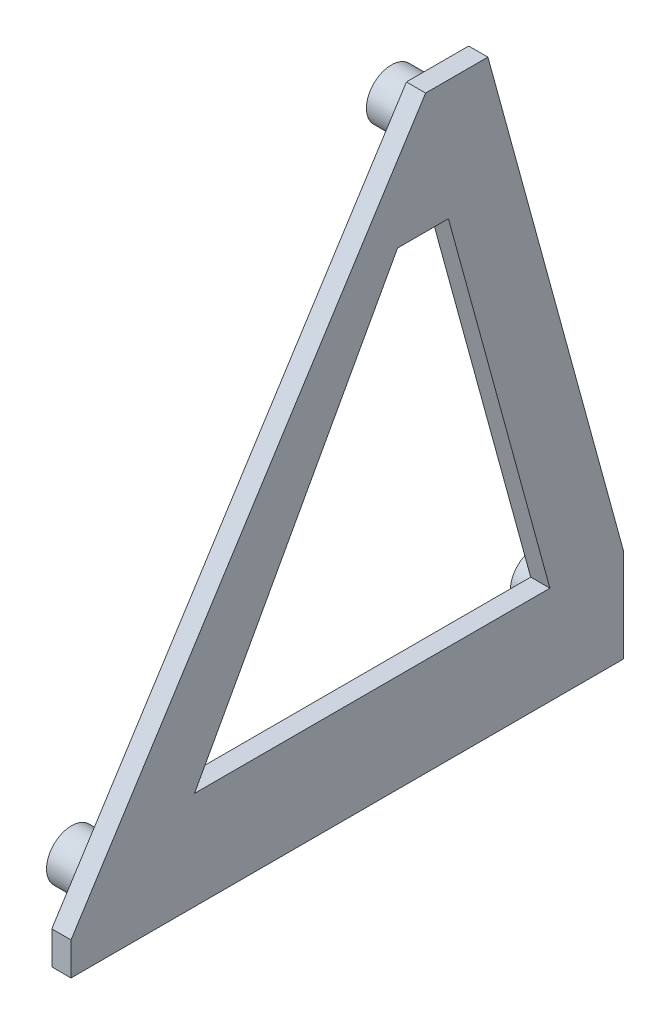
ISO-10303-21;
HEADER;
FILE_DESCRIPTION(('STEP AP214'),'2;1');
FILE_NAME('part.step','',(''),(''),'','','');
FILE_SCHEMA(('AUTOMOTIVE_DESIGN { 1 0 10303 214 1 1 1 1 }'));
ENDSEC;
DATA;
#1=APPLICATION_CONTEXT('core data for automotive mechanical design processes');
#2=APPLICATION_PROTOCOL_DEFINITION('international standard','automotive_design',2000,#1);
#3=PRODUCT_CONTEXT('',#1,'mechanical');
#4=PRODUCT('Part','Part','',(#3));
#5=PRODUCT_RELATED_PRODUCT_CATEGORY('part','',(#4));
#6=PRODUCT_DEFINITION_FORMATION('','',#4);
#7=PRODUCT_DEFINITION_CONTEXT('part definition',#1,'design');
#8=PRODUCT_DEFINITION('design','',#6,#7);
#9=PRODUCT_DEFINITION_SHAPE('','',#8);
#10=(LENGTH_UNIT() NAMED_UNIT(*) SI_UNIT(.MILLI.,.METRE.));
#11=(NAMED_UNIT(*) PLANE_ANGLE_UNIT() SI_UNIT($,.RADIAN.));
#12=(NAMED_UNIT(*) SI_UNIT($,.STERADIAN.) SOLID_ANGLE_UNIT());
#13=UNCERTAINTY_MEASURE_WITH_UNIT(LENGTH_MEASURE(1.E-05),#10,'distance_accuracy_value','');
#14=(GEOMETRIC_REPRESENTATION_CONTEXT(3) GLOBAL_UNCERTAINTY_ASSIGNED_CONTEXT((#13)) GLOBAL_UNIT_ASSIGNED_CONTEXT((#10,
#11,#12)) REPRESENTATION_CONTEXT('',''));
#15=CARTESIAN_POINT('',(0.,0.,0.));
#16=DIRECTION('',(0.,0.,1.));
#17=DIRECTION('',(1.,0.,0.));
#18=AXIS2_PLACEMENT_3D('',#15,#16,#17);
#19=CARTESIAN_POINT('',(0.,0.,0.));
#20=DIRECTION('',(1.,0.,0.));
#21=DIRECTION('',(0.,0.,-1.));
#22=AXIS2_PLACEMENT_3D('',#19,#20,#21);
#23=PLANE('',#22);
#24=CARTESIAN_POINT('',(0.,33.8767009875767,-6.29578165334206));
#25=DIRECTION('',(1.,0.,0.));
#26=DIRECTION('',(0.,0.,-1.));
#27=AXIS2_PLACEMENT_3D('',#24,#25,#26);
#28=CIRCLE('',#27,2.6);
#29=CARTESIAN_POINT('',(0.,33.8767009875767,-8.89578165334206));
#30=VERTEX_POINT('',#29);
#31=EDGE_CURVE('E491',#30,#30,#28,.T.);
#32=ORIENTED_EDGE('',*,*,#31,.T.);
#33=EDGE_LOOP('',(#32));
#34=FACE_BOUND('',#33,.T.);
#35=CARTESIAN_POINT('',(0.,-17.0642630207731,-21.2833827255621));
#36=DIRECTION('',(1.,0.,0.));
#37=DIRECTION('',(0.,0.,-1.));
#38=AXIS2_PLACEMENT_3D('',#35,#36,#37);
#39=CIRCLE('',#38,2.6);
#40=CARTESIAN_POINT('',(0.,-17.0642630207731,-23.8833827255621));
#41=VERTEX_POINT('',#40);
#42=EDGE_CURVE('E318',#41,#41,#39,.T.);
#43=ORIENTED_EDGE('',*,*,#42,.T.);
#44=EDGE_LOOP('',(#43));
#45=FACE_BOUND('',#44,.T.);
#46=CARTESIAN_POINT('',(0.,-18.0642630207731,27.0062641979763));
#47=DIRECTION('',(1.,0.,0.));
#48=DIRECTION('',(0.,0.,-1.));
#49=AXIS2_PLACEMENT_3D('',#46,#47,#48);
#50=CIRCLE('',#49,2.6);
#51=CARTESIAN_POINT('',(0.,-18.0642630207731,24.4062641979763));
#52=VERTEX_POINT('',#51);
#53=EDGE_CURVE('E145',#52,#52,#50,.T.);
#54=ORIENTED_EDGE('',*,*,#53,.T.);
#55=EDGE_LOOP('',(#54));
#56=FACE_BOUND('',#55,.T.);
#57=DIRECTION('',(0.,0.964519820461621,0.264010446643087));
#58=VECTOR('',#57,1.);
#59=CARTESIAN_POINT('',(0.,-12.9534799780657,-16.8003106717052));
#60=LINE('',#59,#58);
#61=CARTESIAN_POINT('',(0.,-12.9534799780657,-16.8003106717052));
#62=VERTEX_POINT('',#61);
#63=CARTESIAN_POINT('',(0.,25.644128730967,-6.23528992412758));
#64=VERTEX_POINT('',#63);
#65=EDGE_CURVE('E127',#62,#64,#60,.T.);
#66=ORIENTED_EDGE('',*,*,#65,.T.);
#67=DIRECTION('',(0.,0.,1.));
#68=VECTOR('',#67,1.);
#69=CARTESIAN_POINT('',(0.,25.644128730967,-6.23528992412758));
#70=LINE('',#69,#68);
#71=CARTESIAN_POINT('',(0.,25.644128730967,-0.937037540538199));
#72=VERTEX_POINT('',#71);
#73=EDGE_CURVE('E120',#64,#72,#70,.T.);
#74=ORIENTED_EDGE('',*,*,#73,.T.);
#75=DIRECTION('',(0.,-0.877051226933812,0.48039686232728));
#76=VECTOR('',#75,1.);
#77=CARTESIAN_POINT('',(0.,25.644128730967,-0.937037540538199));
#78=LINE('',#77,#76);
#79=CARTESIAN_POINT('',(0.,-12.9534799780657,20.2044528852596));
#80=VERTEX_POINT('',#79);
#81=EDGE_CURVE('E130',#72,#80,#78,.T.);
#82=ORIENTED_EDGE('',*,*,#81,.T.);
#83=DIRECTION('',(0.,0.,-1.));
#84=VECTOR('',#83,1.);
#85=CARTESIAN_POINT('',(0.,-12.9534799780657,20.2044528852596));
#86=LINE('',#85,#84);
#87=EDGE_CURVE('E56',#80,#62,#86,.T.);
#88=ORIENTED_EDGE('',*,*,#87,.T.);
#89=EDGE_LOOP('',(#66,#74,#82,#88));
#90=FACE_BOUND('',#89,.T.);
#91=DIRECTION('',(0.,0.,1.));
#92=VECTOR('',#91,1.);
#93=CARTESIAN_POINT('',(0.,38.1571821444435,-10.3448638273174));
#94=LINE('',#93,#92);
#95=CARTESIAN_POINT('',(0.,38.1571821444435,-10.3448638273174));
#96=VERTEX_POINT('',#95);
#97=CARTESIAN_POINT('',(0.,38.1571821444435,-3.86159879742389));
#98=VERTEX_POINT('',#97);
#99=EDGE_CURVE('E169',#96,#98,#94,.T.);
#100=ORIENTED_EDGE('',*,*,#99,.F.);
#101=DIRECTION('',(0.,0.96453296414237,0.263962423618844));
#102=VECTOR('',#101,1.);
#103=CARTESIAN_POINT('',(0.,-13.403843269769,-24.4554994806153));
#104=LINE('',#103,#102);
#105=CARTESIAN_POINT('',(0.,-13.403843269769,-24.4554994806153));
#106=VERTEX_POINT('',#105);
#107=EDGE_CURVE('E189',#106,#96,#104,.T.);
#108=ORIENTED_EDGE('',*,*,#107,.F.);
#109=DIRECTION('',(0.,1.,0.));
#110=VECTOR('',#109,1.);
#111=CARTESIAN_POINT('',(0.,-13.403843269769,-24.4554994806153));
#112=LINE('',#111,#110);
#113=CARTESIAN_POINT('',(0.,-23.1668776677264,-24.4554994806153));
#114=VERTEX_POINT('',#113);
#115=EDGE_CURVE('E185',#114,#106,#112,.T.);
#116=ORIENTED_EDGE('',*,*,#115,.F.);
#117=DIRECTION('',(0.,0.,-1.));
#118=VECTOR('',#117,1.);
#119=CARTESIAN_POINT('',(0.,-23.1668776677264,33.0548750198525));
#120=LINE('',#119,#118);
#121=CARTESIAN_POINT('',(0.,-23.1668776677264,33.0548750198525));
#122=VERTEX_POINT('',#121);
#123=EDGE_CURVE('E181',#122,#114,#120,.T.);
#124=ORIENTED_EDGE('',*,*,#123,.F.);
#125=DIRECTION('',(0.,-1.,0.));
#126=VECTOR('',#125,1.);
#127=CARTESIAN_POINT('',(0.,-19.7345608871945,33.0548750198525));
#128=LINE('',#127,#126);
#129=CARTESIAN_POINT('',(0.,-19.7345608871945,33.0548750198525));
#130=VERTEX_POINT('',#129);
#131=EDGE_CURVE('E177',#130,#122,#128,.T.);
#132=ORIENTED_EDGE('',*,*,#131,.F.);
#133=DIRECTION('',(0.,-0.843157953899936,0.537665941617351));
#134=VECTOR('',#133,1.);
#135=CARTESIAN_POINT('',(0.,38.1571821444435,-3.86159879742388));
#136=LINE('',#135,#134);
#137=EDGE_CURVE('E172',#98,#130,#136,.T.);
#138=ORIENTED_EDGE('',*,*,#137,.F.);
#139=EDGE_LOOP('',(#100,#108,#116,#124,#132,#138));
#140=FACE_BOUND('',#139,.T.);
#141=ADVANCED_FACE('F39',(#34,#45,#56,#90,#140),#23,.F.);
#142=CARTESIAN_POINT('',(0.,38.1571821444435,-10.3448638273174));
#143=DIRECTION('',(0.,1.,0.));
#144=DIRECTION('',(0.,0.,1.));
#145=AXIS2_PLACEMENT_3D('',#142,#143,#144);
#146=PLANE('',#145);
#147=DIRECTION('',(0.,0.,1.));
#148=VECTOR('',#147,1.);
#149=CARTESIAN_POINT('',(2.,38.1571821444435,-10.3448638273174));
#150=LINE('',#149,#148);
#151=CARTESIAN_POINT('',(2.,38.1571821444435,-10.3448638273174));
#152=VERTEX_POINT('',#151);
#153=CARTESIAN_POINT('',(2.,38.1571821444435,-3.86159879742389));
#154=VERTEX_POINT('',#153);
#155=EDGE_CURVE('E163',#152,#154,#150,.T.);
#156=ORIENTED_EDGE('',*,*,#155,.F.);
#157=DIRECTION('',(1.,0.,0.));
#158=VECTOR('',#157,1.);
#159=CARTESIAN_POINT('',(0.,38.1571821444435,-10.3448638273174));
#160=LINE('',#159,#158);
#161=EDGE_CURVE('E215',#96,#152,#160,.T.);
#162=ORIENTED_EDGE('',*,*,#161,.F.);
#163=ORIENTED_EDGE('',*,*,#99,.T.);
#164=DIRECTION('',(1.,0.,0.));
#165=VECTOR('',#164,1.);
#166=CARTESIAN_POINT('',(0.,38.1571821444435,-3.86159879742388));
#167=LINE('',#166,#165);
#168=EDGE_CURVE('E42',#98,#154,#167,.T.);
#169=ORIENTED_EDGE('',*,*,#168,.T.);
#170=EDGE_LOOP('',(#156,#162,#163,#169));
#171=FACE_BOUND('',#170,.T.);
#172=ADVANCED_FACE('F236',(#171),#146,.T.);
#173=CARTESIAN_POINT('',(0.,-13.403843269769,-24.4554994806153));
#174=DIRECTION('',(0.,0.263962423618844,-0.96453296414237));
#175=DIRECTION('',(0.,0.96453296414237,0.263962423618844));
#176=AXIS2_PLACEMENT_3D('',#173,#174,#175);
#177=PLANE('',#176);
#178=DIRECTION('',(0.,0.96453296414237,0.263962423618844));
#179=VECTOR('',#178,1.);
#180=CARTESIAN_POINT('',(2.,-13.403843269769,-24.4554994806153));
#181=LINE('',#180,#179);
#182=CARTESIAN_POINT('',(2.,-13.403843269769,-24.4554994806153));
#183=VERTEX_POINT('',#182);
#184=EDGE_CURVE('E173',#183,#152,#181,.T.);
#185=ORIENTED_EDGE('',*,*,#184,.F.);
#186=DIRECTION('',(1.,0.,0.));
#187=VECTOR('',#186,1.);
#188=CARTESIAN_POINT('',(0.,-13.403843269769,-24.4554994806153));
#189=LINE('',#188,#187);
#190=EDGE_CURVE('E219',#106,#183,#189,.T.);
#191=ORIENTED_EDGE('',*,*,#190,.F.);
#192=ORIENTED_EDGE('',*,*,#107,.T.);
#193=ORIENTED_EDGE('',*,*,#161,.T.);
#194=EDGE_LOOP('',(#185,#191,#192,#193));
#195=FACE_BOUND('',#194,.T.);
#196=ADVANCED_FACE('F245',(#195),#177,.T.);
#197=CARTESIAN_POINT('',(0.,-13.403843269769,-24.4554994806153));
#198=DIRECTION('',(0.,0.,-1.));
#199=DIRECTION('',(-1.,0.,0.));
#200=AXIS2_PLACEMENT_3D('',#197,#198,#199);
#201=PLANE('',#200);
#202=DIRECTION('',(0.,1.,0.));
#203=VECTOR('',#202,1.);
#204=CARTESIAN_POINT('',(2.,-13.403843269769,-24.4554994806153));
#205=LINE('',#204,#203);
#206=CARTESIAN_POINT('',(2.,-23.1668776677264,-24.4554994806153));
#207=VERTEX_POINT('',#206);
#208=EDGE_CURVE('E208',#207,#183,#205,.T.);
#209=ORIENTED_EDGE('',*,*,#208,.F.);
#210=DIRECTION('',(1.,0.,0.));
#211=VECTOR('',#210,1.);
#212=CARTESIAN_POINT('',(0.,-23.1668776677264,-24.4554994806153));
#213=LINE('',#212,#211);
#214=EDGE_CURVE('E222',#114,#207,#213,.T.);
#215=ORIENTED_EDGE('',*,*,#214,.F.);
#216=ORIENTED_EDGE('',*,*,#115,.T.);
#217=ORIENTED_EDGE('',*,*,#190,.T.);
#218=EDGE_LOOP('',(#209,#215,#216,#217));
#219=FACE_BOUND('',#218,.T.);
#220=ADVANCED_FACE('F256',(#219),#201,.T.);
#221=CARTESIAN_POINT('',(0.,-23.1668776677264,33.0548750198525));
#222=DIRECTION('',(0.,-1.,0.));
#223=DIRECTION('',(0.,0.,-1.));
#224=AXIS2_PLACEMENT_3D('',#221,#222,#223);
#225=PLANE('',#224);
#226=DIRECTION('',(0.,0.,-1.));
#227=VECTOR('',#226,1.);
#228=CARTESIAN_POINT('',(2.,-23.1668776677264,33.0548750198525));
#229=LINE('',#228,#227);
#230=CARTESIAN_POINT('',(2.,-23.1668776677264,33.0548750198525));
#231=VERTEX_POINT('',#230);
#232=EDGE_CURVE('E204',#231,#207,#229,.T.);
#233=ORIENTED_EDGE('',*,*,#232,.F.);
#234=DIRECTION('',(1.,0.,0.));
#235=VECTOR('',#234,1.);
#236=CARTESIAN_POINT('',(0.,-23.1668776677264,33.0548750198525));
#237=LINE('',#236,#235);
#238=EDGE_CURVE('E225',#122,#231,#237,.T.);
#239=ORIENTED_EDGE('',*,*,#238,.F.);
#240=ORIENTED_EDGE('',*,*,#123,.T.);
#241=ORIENTED_EDGE('',*,*,#214,.T.);
#242=EDGE_LOOP('',(#233,#239,#240,#241));
#243=FACE_BOUND('',#242,.T.);
#244=ADVANCED_FACE('F254',(#243),#225,.T.);
#245=CARTESIAN_POINT('',(0.,-19.7345608871945,33.0548750198525));
#246=DIRECTION('',(0.,0.,1.));
#247=DIRECTION('',(1.,0.,0.));
#248=AXIS2_PLACEMENT_3D('',#245,#246,#247);
#249=PLANE('',#248);
#250=DIRECTION('',(0.,-1.,0.));
#251=VECTOR('',#250,1.);
#252=CARTESIAN_POINT('',(2.,-19.7345608871945,33.0548750198525));
#253=LINE('',#252,#251);
#254=CARTESIAN_POINT('',(2.,-19.7345608871945,33.0548750198525));
#255=VERTEX_POINT('',#254);
#256=EDGE_CURVE('E200',#255,#231,#253,.T.);
#257=ORIENTED_EDGE('',*,*,#256,.F.);
#258=DIRECTION('',(1.,0.,0.));
#259=VECTOR('',#258,1.);
#260=CARTESIAN_POINT('',(0.,-19.7345608871945,33.0548750198525));
#261=LINE('',#260,#259);
#262=EDGE_CURVE('E227',#130,#255,#261,.T.);
#263=ORIENTED_EDGE('',*,*,#262,.F.);
#264=ORIENTED_EDGE('',*,*,#131,.T.);
#265=ORIENTED_EDGE('',*,*,#238,.T.);
#266=EDGE_LOOP('',(#257,#263,#264,#265));
#267=FACE_BOUND('',#266,.T.);
#268=ADVANCED_FACE('F251',(#267),#249,.T.);
#269=CARTESIAN_POINT('',(0.,38.1571821444435,-3.86159879742388));
#270=DIRECTION('',(0.,0.537665941617351,0.843157953899937));
#271=DIRECTION('',(0.,-0.843157953899936,0.537665941617351));
#272=AXIS2_PLACEMENT_3D('',#269,#270,#271);
#273=PLANE('',#272);
#274=DIRECTION('',(0.,-0.843157953899936,0.537665941617351));
#275=VECTOR('',#274,1.);
#276=CARTESIAN_POINT('',(2.,38.1571821444435,-3.86159879742388));
#277=LINE('',#276,#275);
#278=EDGE_CURVE('E196',#154,#255,#277,.T.);
#279=ORIENTED_EDGE('',*,*,#278,.F.);
#280=ORIENTED_EDGE('',*,*,#168,.F.);
#281=ORIENTED_EDGE('',*,*,#137,.T.);
#282=ORIENTED_EDGE('',*,*,#262,.T.);
#283=EDGE_LOOP('',(#279,#280,#281,#282));
#284=FACE_BOUND('',#283,.T.);
#285=ADVANCED_FACE('F239',(#284),#273,.T.);
#286=CARTESIAN_POINT('',(2.,0.,0.));
#287=DIRECTION('',(1.,0.,0.));
#288=DIRECTION('',(0.,0.,-1.));
#289=AXIS2_PLACEMENT_3D('',#286,#287,#288);
#290=PLANE('',#289);
#291=DIRECTION('',(0.,0.,1.));
#292=VECTOR('',#291,1.);
#293=CARTESIAN_POINT('',(2.,25.644128730967,-6.23528992412758));
#294=LINE('',#293,#292);
#295=CARTESIAN_POINT('',(2.,25.644128730967,-6.23528992412758));
#296=VERTEX_POINT('',#295);
#297=CARTESIAN_POINT('',(2.,25.644128730967,-0.937037540538199));
#298=VERTEX_POINT('',#297);
#299=EDGE_CURVE('E64',#296,#298,#294,.T.);
#300=ORIENTED_EDGE('',*,*,#299,.F.);
#301=DIRECTION('',(0.,0.964519820461621,0.264010446643087));
#302=VECTOR('',#301,1.);
#303=CARTESIAN_POINT('',(2.,-12.9534799780657,-16.8003106717052));
#304=LINE('',#303,#302);
#305=CARTESIAN_POINT('',(2.,-12.9534799780657,-16.8003106717052));
#306=VERTEX_POINT('',#305);
#307=EDGE_CURVE('E138',#306,#296,#304,.T.);
#308=ORIENTED_EDGE('',*,*,#307,.F.);
#309=DIRECTION('',(0.,0.,-1.));
#310=VECTOR('',#309,1.);
#311=CARTESIAN_POINT('',(2.,-12.9534799780657,20.2044528852596));
#312=LINE('',#311,#310);
#313=CARTESIAN_POINT('',(2.,-12.9534799780657,20.2044528852596));
#314=VERTEX_POINT('',#313);
#315=EDGE_CURVE('E142',#314,#306,#312,.T.);
#316=ORIENTED_EDGE('',*,*,#315,.F.);
#317=DIRECTION('',(0.,-0.877051226933812,0.48039686232728));
#318=VECTOR('',#317,1.);
#319=CARTESIAN_POINT('',(2.,25.644128730967,-0.937037540538199));
#320=LINE('',#319,#318);
#321=EDGE_CURVE('E154',#298,#314,#320,.T.);
#322=ORIENTED_EDGE('',*,*,#321,.F.);
#323=EDGE_LOOP('',(#300,#308,#316,#322));
#324=FACE_BOUND('',#323,.T.);
#325=ORIENTED_EDGE('',*,*,#184,.T.);
#326=ORIENTED_EDGE('',*,*,#155,.T.);
#327=ORIENTED_EDGE('',*,*,#278,.T.);
#328=ORIENTED_EDGE('',*,*,#256,.T.);
#329=ORIENTED_EDGE('',*,*,#232,.T.);
#330=ORIENTED_EDGE('',*,*,#208,.T.);
#331=EDGE_LOOP('',(#325,#326,#327,#328,#329,#330));
#332=FACE_BOUND('',#331,.T.);
#333=ADVANCED_FACE('F241',(#324,#332),#290,.T.);
#334=CARTESIAN_POINT('',(0.,25.644128730967,-6.23528992412758));
#335=DIRECTION('',(0.,1.,0.));
#336=DIRECTION('',(0.,0.,1.));
#337=AXIS2_PLACEMENT_3D('',#334,#335,#336);
#338=PLANE('',#337);
#339=ORIENTED_EDGE('',*,*,#299,.T.);
#340=DIRECTION('',(1.,0.,0.));
#341=VECTOR('',#340,1.);
#342=CARTESIAN_POINT('',(0.,25.644128730967,-0.937037540538199));
#343=LINE('',#342,#341);
#344=EDGE_CURVE('E116',#72,#298,#343,.T.);
#345=ORIENTED_EDGE('',*,*,#344,.F.);
#346=ORIENTED_EDGE('',*,*,#73,.F.);
#347=DIRECTION('',(1.,0.,0.));
#348=VECTOR('',#347,1.);
#349=CARTESIAN_POINT('',(0.,25.644128730967,-6.23528992412758));
#350=LINE('',#349,#348);
#351=EDGE_CURVE('E160',#64,#296,#350,.T.);
#352=ORIENTED_EDGE('',*,*,#351,.T.);
#353=EDGE_LOOP('',(#339,#345,#346,#352));
#354=FACE_BOUND('',#353,.T.);
#355=ADVANCED_FACE('F118',(#354),#338,.F.);
#356=CARTESIAN_POINT('',(0.,-12.9534799780657,-16.8003106717052));
#357=DIRECTION('',(0.,0.264010446643087,-0.964519820461621));
#358=DIRECTION('',(0.,0.964519820461621,0.264010446643087));
#359=AXIS2_PLACEMENT_3D('',#356,#357,#358);
#360=PLANE('',#359);
#361=ORIENTED_EDGE('',*,*,#307,.T.);
#362=ORIENTED_EDGE('',*,*,#351,.F.);
#363=ORIENTED_EDGE('',*,*,#65,.F.);
#364=DIRECTION('',(1.,0.,0.));
#365=VECTOR('',#364,1.);
#366=CARTESIAN_POINT('',(0.,-12.9534799780657,-16.8003106717052));
#367=LINE('',#366,#365);
#368=EDGE_CURVE('E164',#62,#306,#367,.T.);
#369=ORIENTED_EDGE('',*,*,#368,.T.);
#370=EDGE_LOOP('',(#361,#362,#363,#369));
#371=FACE_BOUND('',#370,.T.);
#372=ADVANCED_FACE('F348',(#371),#360,.F.);
#373=CARTESIAN_POINT('',(0.,-12.9534799780657,20.2044528852596));
#374=DIRECTION('',(0.,-1.,0.));
#375=DIRECTION('',(0.,0.,-1.));
#376=AXIS2_PLACEMENT_3D('',#373,#374,#375);
#377=PLANE('',#376);
#378=ORIENTED_EDGE('',*,*,#315,.T.);
#379=ORIENTED_EDGE('',*,*,#368,.F.);
#380=ORIENTED_EDGE('',*,*,#87,.F.);
#381=DIRECTION('',(1.,0.,0.));
#382=VECTOR('',#381,1.);
#383=CARTESIAN_POINT('',(0.,-12.9534799780657,20.2044528852596));
#384=LINE('',#383,#382);
#385=EDGE_CURVE('E126',#80,#314,#384,.T.);
#386=ORIENTED_EDGE('',*,*,#385,.T.);
#387=EDGE_LOOP('',(#378,#379,#380,#386));
#388=FACE_BOUND('',#387,.T.);
#389=ADVANCED_FACE('F345',(#388),#377,.F.);
#390=CARTESIAN_POINT('',(0.,25.644128730967,-0.937037540538199));
#391=DIRECTION('',(0.,0.48039686232728,0.877051226933812));
#392=DIRECTION('',(0.,-0.877051226933812,0.48039686232728));
#393=AXIS2_PLACEMENT_3D('',#390,#391,#392);
#394=PLANE('',#393);
#395=ORIENTED_EDGE('',*,*,#321,.T.);
#396=ORIENTED_EDGE('',*,*,#385,.F.);
#397=ORIENTED_EDGE('',*,*,#81,.F.);
#398=ORIENTED_EDGE('',*,*,#344,.T.);
#399=EDGE_LOOP('',(#395,#396,#397,#398));
#400=FACE_BOUND('',#399,.T.);
#401=ADVANCED_FACE('F131',(#400),#394,.F.);
#402=CARTESIAN_POINT('',(-4.,-18.0642630207731,27.0062641979763));
#403=DIRECTION('',(1.,0.,0.));
#404=DIRECTION('',(0.,0.,-1.));
#405=AXIS2_PLACEMENT_3D('',#402,#403,#404);
#406=CYLINDRICAL_SURFACE('',#405,2.6);
#407=CARTESIAN_POINT('',(-4.,-18.0642630207731,27.0062641979763));
#408=DIRECTION('',(1.,0.,0.));
#409=DIRECTION('',(0.,0.,-1.));
#410=AXIS2_PLACEMENT_3D('',#407,#408,#409);
#411=CIRCLE('',#410,2.6);
#412=CARTESIAN_POINT('',(-4.,-18.0642630207731,24.4062641979763));
#413=VERTEX_POINT('',#412);
#414=EDGE_CURVE('E326',#413,#413,#411,.T.);
#415=ORIENTED_EDGE('',*,*,#414,.T.);
#416=EDGE_LOOP('',(#415));
#417=FACE_BOUND('',#416,.T.);
#418=ORIENTED_EDGE('',*,*,#53,.F.);
#419=EDGE_LOOP('',(#418));
#420=FACE_BOUND('',#419,.T.);
#421=ADVANCED_FACE('F336',(#417,#420),#406,.T.);
#422=CARTESIAN_POINT('',(-4.,-18.0642630207731,27.0062641979763));
#423=DIRECTION('',(1.,0.,0.));
#424=DIRECTION('',(0.,0.,-1.));
#425=AXIS2_PLACEMENT_3D('',#422,#423,#424);
#426=CYLINDRICAL_SURFACE('',#425,1.5);
#427=CARTESIAN_POINT('',(-4.,-18.0642630207731,27.0062641979763));
#428=DIRECTION('',(1.,0.,0.));
#429=DIRECTION('',(0.,0.,-1.));
#430=AXIS2_PLACEMENT_3D('',#427,#428,#429);
#431=CIRCLE('',#430,1.5);
#432=CARTESIAN_POINT('',(-4.,-18.0642630207731,25.5062641979763));
#433=VERTEX_POINT('',#432);
#434=EDGE_CURVE('E322',#433,#433,#431,.T.);
#435=ORIENTED_EDGE('',*,*,#434,.F.);
#436=EDGE_LOOP('',(#435));
#437=FACE_BOUND('',#436,.T.);
#438=CARTESIAN_POINT('',(0.,-18.0642630207731,27.0062641979763));
#439=DIRECTION('',(1.,0.,0.));
#440=DIRECTION('',(0.,0.,-1.));
#441=AXIS2_PLACEMENT_3D('',#438,#439,#440);
#442=CIRCLE('',#441,1.5);
#443=CARTESIAN_POINT('',(0.,-18.0642630207731,25.5062641979763));
#444=VERTEX_POINT('',#443);
#445=EDGE_CURVE('E218',#444,#444,#442,.T.);
#446=ORIENTED_EDGE('',*,*,#445,.T.);
#447=EDGE_LOOP('',(#446));
#448=FACE_BOUND('',#447,.T.);
#449=ADVANCED_FACE('F290',(#437,#448),#426,.F.);
#450=CARTESIAN_POINT('',(-4.,-18.0642630207731,27.0062641979763));
#451=DIRECTION('',(1.,0.,0.));
#452=DIRECTION('',(0.,0.,-1.));
#453=AXIS2_PLACEMENT_3D('',#450,#451,#452);
#454=PLANE('',#453);
#455=ORIENTED_EDGE('',*,*,#434,.T.);
#456=EDGE_LOOP('',(#455));
#457=FACE_BOUND('',#456,.T.);
#458=ORIENTED_EDGE('',*,*,#414,.F.);
#459=EDGE_LOOP('',(#458));
#460=FACE_BOUND('',#459,.T.);
#461=ADVANCED_FACE('F281',(#457,#460),#454,.F.);
#462=ORIENTED_EDGE('',*,*,#445,.F.);
#463=EDGE_LOOP('',(#462));
#464=FACE_BOUND('',#463,.T.);
#465=ADVANCED_FACE('F268',(#464),#23,.F.);
#466=CARTESIAN_POINT('',(-4.,-17.0642630207731,-21.2833827255621));
#467=DIRECTION('',(1.,0.,0.));
#468=DIRECTION('',(0.,0.,-1.));
#469=AXIS2_PLACEMENT_3D('',#466,#467,#468);
#470=CYLINDRICAL_SURFACE('',#469,2.6);
#471=CARTESIAN_POINT('',(-4.,-17.0642630207731,-21.2833827255621));
#472=DIRECTION('',(1.,0.,0.));
#473=DIRECTION('',(0.,0.,-1.));
#474=AXIS2_PLACEMENT_3D('',#471,#472,#473);
#475=CIRCLE('',#474,2.6);
#476=CARTESIAN_POINT('',(-4.,-17.0642630207731,-23.8833827255621));
#477=VERTEX_POINT('',#476);
#478=EDGE_CURVE('E316',#477,#477,#475,.T.);
#479=ORIENTED_EDGE('',*,*,#478,.T.);
#480=EDGE_LOOP('',(#479));
#481=FACE_BOUND('',#480,.T.);
#482=ORIENTED_EDGE('',*,*,#42,.F.);
#483=EDGE_LOOP('',(#482));
#484=FACE_BOUND('',#483,.T.);
#485=ADVANCED_FACE('F280',(#481,#484),#470,.T.);
#486=CARTESIAN_POINT('',(-4.,-17.0642630207731,-21.2833827255621));
#487=DIRECTION('',(1.,0.,0.));
#488=DIRECTION('',(0.,0.,-1.));
#489=AXIS2_PLACEMENT_3D('',#486,#487,#488);
#490=CYLINDRICAL_SURFACE('',#489,1.5);
#491=CARTESIAN_POINT('',(-4.,-17.0642630207731,-21.2833827255621));
#492=DIRECTION('',(1.,0.,0.));
#493=DIRECTION('',(0.,0.,-1.));
#494=AXIS2_PLACEMENT_3D('',#491,#492,#493);
#495=CIRCLE('',#494,1.5);
#496=CARTESIAN_POINT('',(-4.,-17.0642630207731,-22.7833827255621));
#497=VERTEX_POINT('',#496);
#498=EDGE_CURVE('E495',#497,#497,#495,.T.);
#499=ORIENTED_EDGE('',*,*,#498,.F.);
#500=EDGE_LOOP('',(#499));
#501=FACE_BOUND('',#500,.T.);
#502=CARTESIAN_POINT('',(0.,-17.0642630207731,-21.2833827255621));
#503=DIRECTION('',(1.,0.,0.));
#504=DIRECTION('',(0.,0.,-1.));
#505=AXIS2_PLACEMENT_3D('',#502,#503,#504);
#506=CIRCLE('',#505,1.5);
#507=CARTESIAN_POINT('',(0.,-17.0642630207731,-22.7833827255621));
#508=VERTEX_POINT('',#507);
#509=EDGE_CURVE('E48',#508,#508,#506,.T.);
#510=ORIENTED_EDGE('',*,*,#509,.T.);
#511=EDGE_LOOP('',(#510));
#512=FACE_BOUND('',#511,.T.);
#513=ADVANCED_FACE('F287',(#501,#512),#490,.F.);
#514=CARTESIAN_POINT('',(-4.,-17.0642630207731,-21.2833827255621));
#515=DIRECTION('',(1.,0.,0.));
#516=DIRECTION('',(0.,0.,-1.));
#517=AXIS2_PLACEMENT_3D('',#514,#515,#516);
#518=PLANE('',#517);
#519=ORIENTED_EDGE('',*,*,#498,.T.);
#520=EDGE_LOOP('',(#519));
#521=FACE_BOUND('',#520,.T.);
#522=ORIENTED_EDGE('',*,*,#478,.F.);
#523=EDGE_LOOP('',(#522));
#524=FACE_BOUND('',#523,.T.);
#525=ADVANCED_FACE('F296',(#521,#524),#518,.F.);
#526=ORIENTED_EDGE('',*,*,#509,.F.);
#527=EDGE_LOOP('',(#526));
#528=FACE_BOUND('',#527,.T.);
#529=ADVANCED_FACE('F278',(#528),#23,.F.);
#530=CARTESIAN_POINT('',(-4.,33.8767009875767,-6.29578165334206));
#531=DIRECTION('',(1.,0.,0.));
#532=DIRECTION('',(0.,0.,-1.));
#533=AXIS2_PLACEMENT_3D('',#530,#531,#532);
#534=CYLINDRICAL_SURFACE('',#533,2.6);
#535=CARTESIAN_POINT('',(-4.,33.8767009875767,-6.29578165334206));
#536=DIRECTION('',(1.,0.,0.));
#537=DIRECTION('',(0.,0.,-1.));
#538=AXIS2_PLACEMENT_3D('',#535,#536,#537);
#539=CIRCLE('',#538,2.6);
#540=CARTESIAN_POINT('',(-4.,33.8767009875767,-8.89578165334206));
#541=VERTEX_POINT('',#540);
#542=EDGE_CURVE('E489',#541,#541,#539,.T.);
#543=ORIENTED_EDGE('',*,*,#542,.T.);
#544=EDGE_LOOP('',(#543));
#545=FACE_BOUND('',#544,.T.);
#546=ORIENTED_EDGE('',*,*,#31,.F.);
#547=EDGE_LOOP('',(#546));
#548=FACE_BOUND('',#547,.T.);
#549=ADVANCED_FACE('F295',(#545,#548),#534,.T.);
#550=CARTESIAN_POINT('',(-4.,33.8767009875767,-6.29578165334206));
#551=DIRECTION('',(1.,0.,0.));
#552=DIRECTION('',(0.,0.,-1.));
#553=AXIS2_PLACEMENT_3D('',#550,#551,#552);
#554=CYLINDRICAL_SURFACE('',#553,1.5);
#555=CARTESIAN_POINT('',(-4.,33.8767009875767,-6.29578165334206));
#556=DIRECTION('',(1.,0.,0.));
#557=DIRECTION('',(0.,0.,-1.));
#558=AXIS2_PLACEMENT_3D('',#555,#556,#557);
#559=CIRCLE('',#558,1.5);
#560=CARTESIAN_POINT('',(-4.,33.8767009875767,-7.79578165334206));
#561=VERTEX_POINT('',#560);
#562=EDGE_CURVE('E486',#561,#561,#559,.T.);
#563=ORIENTED_EDGE('',*,*,#562,.F.);
#564=EDGE_LOOP('',(#563));
#565=FACE_BOUND('',#564,.T.);
#566=CARTESIAN_POINT('',(0.,33.8767009875767,-6.29578165334206));
#567=DIRECTION('',(1.,0.,0.));
#568=DIRECTION('',(0.,0.,-1.));
#569=AXIS2_PLACEMENT_3D('',#566,#567,#568);
#570=CIRCLE('',#569,1.5);
#571=CARTESIAN_POINT('',(0.,33.8767009875767,-7.79578165334206));
#572=VERTEX_POINT('',#571);
#573=EDGE_CURVE('E11',#572,#572,#570,.T.);
#574=ORIENTED_EDGE('',*,*,#573,.T.);
#575=EDGE_LOOP('',(#574));
#576=FACE_BOUND('',#575,.T.);
#577=ADVANCED_FACE('F302',(#565,#576),#554,.F.);
#578=CARTESIAN_POINT('',(-4.,33.8767009875767,-6.29578165334206));
#579=DIRECTION('',(1.,0.,0.));
#580=DIRECTION('',(0.,0.,-1.));
#581=AXIS2_PLACEMENT_3D('',#578,#579,#580);
#582=PLANE('',#581);
#583=ORIENTED_EDGE('',*,*,#562,.T.);
#584=EDGE_LOOP('',(#583));
#585=FACE_BOUND('',#584,.T.);
#586=ORIENTED_EDGE('',*,*,#542,.F.);
#587=EDGE_LOOP('',(#586));
#588=FACE_BOUND('',#587,.T.);
#589=ADVANCED_FACE('F276',(#585,#588),#582,.F.);
#590=ORIENTED_EDGE('',*,*,#573,.F.);
#591=EDGE_LOOP('',(#590));
#592=FACE_BOUND('',#591,.T.);
#593=ADVANCED_FACE('F267',(#592),#23,.F.);
#594=CLOSED_SHELL('',(#141,#172,#196,#220,#244,#268,#285,#333,#355,#372,#389,#401,#421,#449,
#461,#465,#485,#513,#525,#529,#549,#577,#589,#593));
#595=MANIFOLD_SOLID_BREP('B2',#594);
#596=ADVANCED_BREP_SHAPE_REPRESENTATION('',(#18,#595),#14);
#597=SHAPE_DEFINITION_REPRESENTATION(#9,#596);
ENDSEC;
END-ISO-10303-21;
